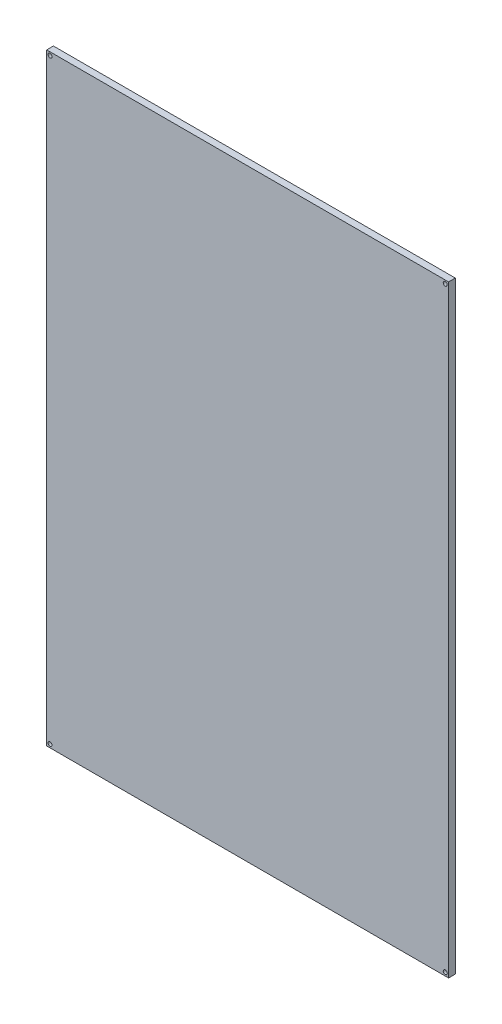
ISO-10303-21;
HEADER;
FILE_DESCRIPTION(('STEP AP214'),'2;1');
FILE_NAME('part.step','',(''),(''),'','','');
FILE_SCHEMA(('AUTOMOTIVE_DESIGN { 1 0 10303 214 1 1 1 1 }'));
ENDSEC;
DATA;
#1=APPLICATION_CONTEXT('core data for automotive mechanical design processes');
#2=APPLICATION_PROTOCOL_DEFINITION('international standard','automotive_design',2000,#1);
#3=PRODUCT_CONTEXT('',#1,'mechanical');
#4=PRODUCT('Part','Part','',(#3));
#5=PRODUCT_RELATED_PRODUCT_CATEGORY('part','',(#4));
#6=PRODUCT_DEFINITION_FORMATION('','',#4);
#7=PRODUCT_DEFINITION_CONTEXT('part definition',#1,'design');
#8=PRODUCT_DEFINITION('design','',#6,#7);
#9=PRODUCT_DEFINITION_SHAPE('','',#8);
#10=(LENGTH_UNIT() NAMED_UNIT(*) SI_UNIT(.MILLI.,.METRE.));
#11=(NAMED_UNIT(*) PLANE_ANGLE_UNIT() SI_UNIT($,.RADIAN.));
#12=(NAMED_UNIT(*) SI_UNIT($,.STERADIAN.) SOLID_ANGLE_UNIT());
#13=UNCERTAINTY_MEASURE_WITH_UNIT(LENGTH_MEASURE(1.E-05),#10,'distance_accuracy_value','');
#14=(GEOMETRIC_REPRESENTATION_CONTEXT(3) GLOBAL_UNCERTAINTY_ASSIGNED_CONTEXT((#13)) GLOBAL_UNIT_ASSIGNED_CONTEXT((#10,
#11,#12)) REPRESENTATION_CONTEXT('',''));
#15=CARTESIAN_POINT('',(0.,0.,0.));
#16=DIRECTION('',(0.,0.,1.));
#17=DIRECTION('',(1.,0.,0.));
#18=AXIS2_PLACEMENT_3D('',#15,#16,#17);
#19=CARTESIAN_POINT('',(150.,225.,5.));
#20=DIRECTION('',(-1.,0.,0.));
#21=DIRECTION('',(0.,-1.,0.));
#22=AXIS2_PLACEMENT_3D('',#19,#20,#21);
#23=PLANE('',#22);
#24=DIRECTION('',(0.,1.,0.));
#25=VECTOR('',#24,1.);
#26=CARTESIAN_POINT('',(150.,225.,0.));
#27=LINE('',#26,#25);
#28=CARTESIAN_POINT('',(150.,-225.,0.));
#29=VERTEX_POINT('',#28);
#30=CARTESIAN_POINT('',(150.,225.,0.));
#31=VERTEX_POINT('',#30);
#32=EDGE_CURVE('E107',#29,#31,#27,.T.);
#33=ORIENTED_EDGE('',*,*,#32,.T.);
#34=DIRECTION('',(0.,0.,-1.));
#35=VECTOR('',#34,1.);
#36=CARTESIAN_POINT('',(150.,225.,5.));
#37=LINE('',#36,#35);
#38=CARTESIAN_POINT('',(150.,225.,5.));
#39=VERTEX_POINT('',#38);
#40=EDGE_CURVE('E11',#39,#31,#37,.T.);
#41=ORIENTED_EDGE('',*,*,#40,.F.);
#42=DIRECTION('',(0.,1.,0.));
#43=VECTOR('',#42,1.);
#44=CARTESIAN_POINT('',(150.,225.,5.));
#45=LINE('',#44,#43);
#46=CARTESIAN_POINT('',(150.,-225.,5.));
#47=VERTEX_POINT('',#46);
#48=EDGE_CURVE('E91',#47,#39,#45,.T.);
#49=ORIENTED_EDGE('',*,*,#48,.F.);
#50=DIRECTION('',(0.,0.,-1.));
#51=VECTOR('',#50,1.);
#52=CARTESIAN_POINT('',(150.,-225.,5.));
#53=LINE('',#52,#51);
#54=EDGE_CURVE('E103',#47,#29,#53,.T.);
#55=ORIENTED_EDGE('',*,*,#54,.T.);
#56=EDGE_LOOP('',(#33,#41,#49,#55));
#57=FACE_BOUND('',#56,.T.);
#58=ADVANCED_FACE('F39',(#57),#23,.F.);
#59=CARTESIAN_POINT('',(-150.,225.,5.));
#60=DIRECTION('',(0.,-1.,0.));
#61=DIRECTION('',(0.,0.,-1.));
#62=AXIS2_PLACEMENT_3D('',#59,#60,#61);
#63=PLANE('',#62);
#64=DIRECTION('',(-1.,0.,0.));
#65=VECTOR('',#64,1.);
#66=CARTESIAN_POINT('',(-150.,225.,0.));
#67=LINE('',#66,#65);
#68=CARTESIAN_POINT('',(-150.,225.,0.));
#69=VERTEX_POINT('',#68);
#70=EDGE_CURVE('E96',#31,#69,#67,.T.);
#71=ORIENTED_EDGE('',*,*,#70,.T.);
#72=DIRECTION('',(0.,0.,-1.));
#73=VECTOR('',#72,1.);
#74=CARTESIAN_POINT('',(-150.,225.,5.));
#75=LINE('',#74,#73);
#76=CARTESIAN_POINT('',(-150.,225.,5.));
#77=VERTEX_POINT('',#76);
#78=EDGE_CURVE('E48',#77,#69,#75,.T.);
#79=ORIENTED_EDGE('',*,*,#78,.F.);
#80=DIRECTION('',(-1.,0.,0.));
#81=VECTOR('',#80,1.);
#82=CARTESIAN_POINT('',(-150.,225.,5.));
#83=LINE('',#82,#81);
#84=EDGE_CURVE('E86',#39,#77,#83,.T.);
#85=ORIENTED_EDGE('',*,*,#84,.F.);
#86=ORIENTED_EDGE('',*,*,#40,.T.);
#87=EDGE_LOOP('',(#71,#79,#85,#86));
#88=FACE_BOUND('',#87,.T.);
#89=ADVANCED_FACE('F95',(#88),#63,.F.);
#90=CARTESIAN_POINT('',(-150.,225.,5.));
#91=DIRECTION('',(1.,0.,0.));
#92=DIRECTION('',(0.,1.,0.));
#93=AXIS2_PLACEMENT_3D('',#90,#91,#92);
#94=PLANE('',#93);
#95=DIRECTION('',(0.,-1.,0.));
#96=VECTOR('',#95,1.);
#97=CARTESIAN_POINT('',(-150.,225.,0.));
#98=LINE('',#97,#96);
#99=CARTESIAN_POINT('',(-150.,-225.,0.));
#100=VERTEX_POINT('',#99);
#101=EDGE_CURVE('E73',#69,#100,#98,.T.);
#102=ORIENTED_EDGE('',*,*,#101,.T.);
#103=DIRECTION('',(0.,0.,-1.));
#104=VECTOR('',#103,1.);
#105=CARTESIAN_POINT('',(-150.,-225.,5.));
#106=LINE('',#105,#104);
#107=CARTESIAN_POINT('',(-150.,-225.,5.));
#108=VERTEX_POINT('',#107);
#109=EDGE_CURVE('E98',#108,#100,#106,.T.);
#110=ORIENTED_EDGE('',*,*,#109,.F.);
#111=DIRECTION('',(0.,-1.,0.));
#112=VECTOR('',#111,1.);
#113=CARTESIAN_POINT('',(-150.,225.,5.));
#114=LINE('',#113,#112);
#115=EDGE_CURVE('E89',#77,#108,#114,.T.);
#116=ORIENTED_EDGE('',*,*,#115,.F.);
#117=ORIENTED_EDGE('',*,*,#78,.T.);
#118=EDGE_LOOP('',(#102,#110,#116,#117));
#119=FACE_BOUND('',#118,.T.);
#120=ADVANCED_FACE('F99',(#119),#94,.F.);
#121=CARTESIAN_POINT('',(-150.,-225.,5.));
#122=DIRECTION('',(0.,1.,0.));
#123=DIRECTION('',(0.,0.,1.));
#124=AXIS2_PLACEMENT_3D('',#121,#122,#123);
#125=PLANE('',#124);
#126=DIRECTION('',(1.,0.,0.));
#127=VECTOR('',#126,1.);
#128=CARTESIAN_POINT('',(-150.,-225.,0.));
#129=LINE('',#128,#127);
#130=EDGE_CURVE('E79',#100,#29,#129,.T.);
#131=ORIENTED_EDGE('',*,*,#130,.T.);
#132=ORIENTED_EDGE('',*,*,#54,.F.);
#133=DIRECTION('',(1.,0.,0.));
#134=VECTOR('',#133,1.);
#135=CARTESIAN_POINT('',(-150.,-225.,5.));
#136=LINE('',#135,#134);
#137=EDGE_CURVE('E56',#108,#47,#136,.T.);
#138=ORIENTED_EDGE('',*,*,#137,.F.);
#139=ORIENTED_EDGE('',*,*,#109,.T.);
#140=EDGE_LOOP('',(#131,#132,#138,#139));
#141=FACE_BOUND('',#140,.T.);
#142=ADVANCED_FACE('F121',(#141),#125,.F.);
#143=CARTESIAN_POINT('',(0.,0.,5.));
#144=DIRECTION('',(0.,0.,1.));
#145=DIRECTION('',(1.,0.,0.));
#146=AXIS2_PLACEMENT_3D('',#143,#144,#145);
#147=PLANE('',#146);
#148=CARTESIAN_POINT('',(-147.5,222.5,5.));
#149=DIRECTION('',(0.,0.,1.));
#150=DIRECTION('',(1.,0.,0.));
#151=AXIS2_PLACEMENT_3D('',#148,#149,#150);
#152=CIRCLE('',#151,1.5);
#153=CARTESIAN_POINT('',(-146.,222.5,5.));
#154=VERTEX_POINT('',#153);
#155=EDGE_CURVE('E145',#154,#154,#152,.T.);
#156=ORIENTED_EDGE('',*,*,#155,.F.);
#157=EDGE_LOOP('',(#156));
#158=FACE_BOUND('',#157,.T.);
#159=CARTESIAN_POINT('',(147.5,-222.5,5.));
#160=DIRECTION('',(0.,0.,1.));
#161=DIRECTION('',(1.,0.,0.));
#162=AXIS2_PLACEMENT_3D('',#159,#160,#161);
#163=CIRCLE('',#162,1.5);
#164=CARTESIAN_POINT('',(149.,-222.5,5.));
#165=VERTEX_POINT('',#164);
#166=EDGE_CURVE('E136',#165,#165,#163,.T.);
#167=ORIENTED_EDGE('',*,*,#166,.F.);
#168=EDGE_LOOP('',(#167));
#169=FACE_BOUND('',#168,.T.);
#170=CARTESIAN_POINT('',(147.5,222.5,5.));
#171=DIRECTION('',(0.,0.,1.));
#172=DIRECTION('',(1.,0.,0.));
#173=AXIS2_PLACEMENT_3D('',#170,#171,#172);
#174=CIRCLE('',#173,1.5);
#175=CARTESIAN_POINT('',(149.,222.5,5.));
#176=VERTEX_POINT('',#175);
#177=EDGE_CURVE('E152',#176,#176,#174,.T.);
#178=ORIENTED_EDGE('',*,*,#177,.F.);
#179=EDGE_LOOP('',(#178));
#180=FACE_BOUND('',#179,.T.);
#181=CARTESIAN_POINT('',(-147.5,-222.5,5.));
#182=DIRECTION('',(0.,0.,1.));
#183=DIRECTION('',(1.,0.,0.));
#184=AXIS2_PLACEMENT_3D('',#181,#182,#183);
#185=CIRCLE('',#184,1.5);
#186=CARTESIAN_POINT('',(-146.,-222.5,5.));
#187=VERTEX_POINT('',#186);
#188=EDGE_CURVE('E128',#187,#187,#185,.T.);
#189=ORIENTED_EDGE('',*,*,#188,.F.);
#190=EDGE_LOOP('',(#189));
#191=FACE_BOUND('',#190,.T.);
#192=ORIENTED_EDGE('',*,*,#48,.T.);
#193=ORIENTED_EDGE('',*,*,#84,.T.);
#194=ORIENTED_EDGE('',*,*,#115,.T.);
#195=ORIENTED_EDGE('',*,*,#137,.T.);
#196=EDGE_LOOP('',(#192,#193,#194,#195));
#197=FACE_BOUND('',#196,.T.);
#198=ADVANCED_FACE('F87',(#158,#169,#180,#191,#197),#147,.T.);
#199=CARTESIAN_POINT('',(0.,0.,0.));
#200=DIRECTION('',(0.,0.,1.));
#201=DIRECTION('',(1.,0.,0.));
#202=AXIS2_PLACEMENT_3D('',#199,#200,#201);
#203=PLANE('',#202);
#204=CARTESIAN_POINT('',(-147.5,222.5,0.));
#205=DIRECTION('',(0.,0.,1.));
#206=DIRECTION('',(1.,0.,0.));
#207=AXIS2_PLACEMENT_3D('',#204,#205,#206);
#208=CIRCLE('',#207,1.5);
#209=CARTESIAN_POINT('',(-146.,222.5,0.));
#210=VERTEX_POINT('',#209);
#211=EDGE_CURVE('E132',#210,#210,#208,.T.);
#212=ORIENTED_EDGE('',*,*,#211,.T.);
#213=EDGE_LOOP('',(#212));
#214=FACE_BOUND('',#213,.T.);
#215=CARTESIAN_POINT('',(147.5,-222.5,0.));
#216=DIRECTION('',(0.,0.,1.));
#217=DIRECTION('',(1.,0.,0.));
#218=AXIS2_PLACEMENT_3D('',#215,#216,#217);
#219=CIRCLE('',#218,1.5);
#220=CARTESIAN_POINT('',(149.,-222.5,0.));
#221=VERTEX_POINT('',#220);
#222=EDGE_CURVE('E140',#221,#221,#219,.T.);
#223=ORIENTED_EDGE('',*,*,#222,.T.);
#224=EDGE_LOOP('',(#223));
#225=FACE_BOUND('',#224,.T.);
#226=CARTESIAN_POINT('',(147.5,222.5,0.));
#227=DIRECTION('',(0.,0.,1.));
#228=DIRECTION('',(1.,0.,0.));
#229=AXIS2_PLACEMENT_3D('',#226,#227,#228);
#230=CIRCLE('',#229,1.5);
#231=CARTESIAN_POINT('',(149.,222.5,0.));
#232=VERTEX_POINT('',#231);
#233=EDGE_CURVE('E141',#232,#232,#230,.T.);
#234=ORIENTED_EDGE('',*,*,#233,.T.);
#235=EDGE_LOOP('',(#234));
#236=FACE_BOUND('',#235,.T.);
#237=CARTESIAN_POINT('',(-147.5,-222.5,0.));
#238=DIRECTION('',(0.,0.,1.));
#239=DIRECTION('',(1.,0.,0.));
#240=AXIS2_PLACEMENT_3D('',#237,#238,#239);
#241=CIRCLE('',#240,1.5);
#242=CARTESIAN_POINT('',(-146.,-222.5,0.));
#243=VERTEX_POINT('',#242);
#244=EDGE_CURVE('E111',#243,#243,#241,.T.);
#245=ORIENTED_EDGE('',*,*,#244,.T.);
#246=EDGE_LOOP('',(#245));
#247=FACE_BOUND('',#246,.T.);
#248=ORIENTED_EDGE('',*,*,#32,.F.);
#249=ORIENTED_EDGE('',*,*,#130,.F.);
#250=ORIENTED_EDGE('',*,*,#101,.F.);
#251=ORIENTED_EDGE('',*,*,#70,.F.);
#252=EDGE_LOOP('',(#248,#249,#250,#251));
#253=FACE_BOUND('',#252,.T.);
#254=ADVANCED_FACE('F124',(#214,#225,#236,#247,#253),#203,.F.);
#255=CARTESIAN_POINT('',(-147.5,-222.5,0.));
#256=DIRECTION('',(0.,0.,1.));
#257=DIRECTION('',(1.,0.,0.));
#258=AXIS2_PLACEMENT_3D('',#255,#256,#257);
#259=CYLINDRICAL_SURFACE('',#258,1.5);
#260=ORIENTED_EDGE('',*,*,#244,.F.);
#261=EDGE_LOOP('',(#260));
#262=FACE_BOUND('',#261,.T.);
#263=ORIENTED_EDGE('',*,*,#188,.T.);
#264=EDGE_LOOP('',(#263));
#265=FACE_BOUND('',#264,.T.);
#266=ADVANCED_FACE('F166',(#262,#265),#259,.F.);
#267=CARTESIAN_POINT('',(147.5,222.5,0.));
#268=DIRECTION('',(0.,0.,1.));
#269=DIRECTION('',(1.,0.,0.));
#270=AXIS2_PLACEMENT_3D('',#267,#268,#269);
#271=CYLINDRICAL_SURFACE('',#270,1.5);
#272=ORIENTED_EDGE('',*,*,#233,.F.);
#273=EDGE_LOOP('',(#272));
#274=FACE_BOUND('',#273,.T.);
#275=ORIENTED_EDGE('',*,*,#177,.T.);
#276=EDGE_LOOP('',(#275));
#277=FACE_BOUND('',#276,.T.);
#278=ADVANCED_FACE('F162',(#274,#277),#271,.F.);
#279=CARTESIAN_POINT('',(147.5,-222.5,0.));
#280=DIRECTION('',(0.,0.,1.));
#281=DIRECTION('',(1.,0.,0.));
#282=AXIS2_PLACEMENT_3D('',#279,#280,#281);
#283=CYLINDRICAL_SURFACE('',#282,1.5);
#284=ORIENTED_EDGE('',*,*,#222,.F.);
#285=EDGE_LOOP('',(#284));
#286=FACE_BOUND('',#285,.T.);
#287=ORIENTED_EDGE('',*,*,#166,.T.);
#288=EDGE_LOOP('',(#287));
#289=FACE_BOUND('',#288,.T.);
#290=ADVANCED_FACE('F165',(#286,#289),#283,.F.);
#291=CARTESIAN_POINT('',(-147.5,222.5,0.));
#292=DIRECTION('',(0.,0.,1.));
#293=DIRECTION('',(1.,0.,0.));
#294=AXIS2_PLACEMENT_3D('',#291,#292,#293);
#295=CYLINDRICAL_SURFACE('',#294,1.5);
#296=ORIENTED_EDGE('',*,*,#211,.F.);
#297=EDGE_LOOP('',(#296));
#298=FACE_BOUND('',#297,.T.);
#299=ORIENTED_EDGE('',*,*,#155,.T.);
#300=EDGE_LOOP('',(#299));
#301=FACE_BOUND('',#300,.T.);
#302=ADVANCED_FACE('F227',(#298,#301),#295,.F.);
#303=CLOSED_SHELL('',(#58,#89,#120,#142,#198,#254,#266,#278,#290,#302));
#304=MANIFOLD_SOLID_BREP('B2',#303);
#305=ADVANCED_BREP_SHAPE_REPRESENTATION('',(#18,#304),#14);
#306=SHAPE_DEFINITION_REPRESENTATION(#9,#305);
ENDSEC;
END-ISO-10303-21;
